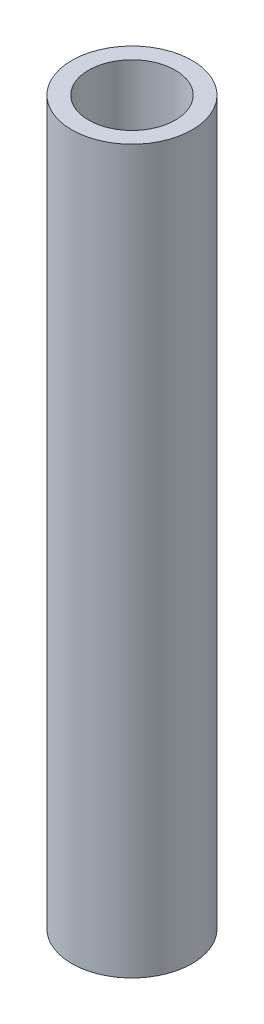
ISO-10303-21;
HEADER;
FILE_DESCRIPTION(('STEP AP214'),'2;1');
FILE_NAME('part.step','',(''),(''),'','','');
FILE_SCHEMA(('AUTOMOTIVE_DESIGN { 1 0 10303 214 1 1 1 1 }'));
ENDSEC;
DATA;
#1=APPLICATION_CONTEXT('core data for automotive mechanical design processes');
#2=APPLICATION_PROTOCOL_DEFINITION('international standard','automotive_design',2000,#1);
#3=PRODUCT_CONTEXT('',#1,'mechanical');
#4=PRODUCT('Part','Part','',(#3));
#5=PRODUCT_RELATED_PRODUCT_CATEGORY('part','',(#4));
#6=PRODUCT_DEFINITION_FORMATION('','',#4);
#7=PRODUCT_DEFINITION_CONTEXT('part definition',#1,'design');
#8=PRODUCT_DEFINITION('design','',#6,#7);
#9=PRODUCT_DEFINITION_SHAPE('','',#8);
#10=(LENGTH_UNIT() NAMED_UNIT(*) SI_UNIT(.MILLI.,.METRE.));
#11=(NAMED_UNIT(*) PLANE_ANGLE_UNIT() SI_UNIT($,.RADIAN.));
#12=(NAMED_UNIT(*) SI_UNIT($,.STERADIAN.) SOLID_ANGLE_UNIT());
#13=UNCERTAINTY_MEASURE_WITH_UNIT(LENGTH_MEASURE(1.E-05),#10,'distance_accuracy_value','');
#14=(GEOMETRIC_REPRESENTATION_CONTEXT(3) GLOBAL_UNCERTAINTY_ASSIGNED_CONTEXT((#13)) GLOBAL_UNIT_ASSIGNED_CONTEXT((#10,
#11,#12)) REPRESENTATION_CONTEXT('',''));
#15=CARTESIAN_POINT('',(0.,0.,0.));
#16=DIRECTION('',(0.,0.,1.));
#17=DIRECTION('',(1.,0.,0.));
#18=AXIS2_PLACEMENT_3D('',#15,#16,#17);
#19=CARTESIAN_POINT('',(0.,38.1,0.));
#20=DIRECTION('',(0.,1.,0.));
#21=DIRECTION('',(0.,0.,1.));
#22=AXIS2_PLACEMENT_3D('',#19,#20,#21);
#23=PLANE('',#22);
#24=CARTESIAN_POINT('',(0.,38.1,0.));
#25=DIRECTION('',(0.,1.,0.));
#26=DIRECTION('',(0.,0.,1.));
#27=AXIS2_PLACEMENT_3D('',#24,#25,#26);
#28=CIRCLE('',#27,3.175);
#29=CARTESIAN_POINT('',(0.,38.1,3.175));
#30=VERTEX_POINT('',#29);
#31=EDGE_CURVE('E10',#30,#30,#28,.T.);
#32=ORIENTED_EDGE('',*,*,#31,.T.);
#33=EDGE_LOOP('',(#32));
#34=FACE_BOUND('',#33,.T.);
#35=CARTESIAN_POINT('',(0.,38.1,0.));
#36=DIRECTION('',(0.,1.,0.));
#37=DIRECTION('',(0.,0.,1.));
#38=AXIS2_PLACEMENT_3D('',#35,#36,#37);
#39=CIRCLE('',#38,2.286);
#40=CARTESIAN_POINT('',(0.,38.1,2.286));
#41=VERTEX_POINT('',#40);
#42=EDGE_CURVE('E43',#41,#41,#39,.T.);
#43=ORIENTED_EDGE('',*,*,#42,.F.);
#44=EDGE_LOOP('',(#43));
#45=FACE_BOUND('',#44,.T.);
#46=ADVANCED_FACE('F32',(#34,#45),#23,.T.);
#47=CARTESIAN_POINT('',(0.,0.,0.));
#48=DIRECTION('',(0.,1.,0.));
#49=DIRECTION('',(0.,0.,1.));
#50=AXIS2_PLACEMENT_3D('',#47,#48,#49);
#51=PLANE('',#50);
#52=CARTESIAN_POINT('',(0.,0.,0.));
#53=DIRECTION('',(0.,1.,0.));
#54=DIRECTION('',(0.,0.,1.));
#55=AXIS2_PLACEMENT_3D('',#52,#53,#54);
#56=CIRCLE('',#55,3.175);
#57=CARTESIAN_POINT('',(0.,0.,3.175));
#58=VERTEX_POINT('',#57);
#59=EDGE_CURVE('E36',#58,#58,#56,.T.);
#60=ORIENTED_EDGE('',*,*,#59,.F.);
#61=EDGE_LOOP('',(#60));
#62=FACE_BOUND('',#61,.T.);
#63=CARTESIAN_POINT('',(0.,0.,0.));
#64=DIRECTION('',(0.,1.,0.));
#65=DIRECTION('',(0.,0.,1.));
#66=AXIS2_PLACEMENT_3D('',#63,#64,#65);
#67=CIRCLE('',#66,2.286);
#68=CARTESIAN_POINT('',(0.,0.,2.286));
#69=VERTEX_POINT('',#68);
#70=EDGE_CURVE('E45',#69,#69,#67,.T.);
#71=ORIENTED_EDGE('',*,*,#70,.T.);
#72=EDGE_LOOP('',(#71));
#73=FACE_BOUND('',#72,.T.);
#74=ADVANCED_FACE('F55',(#62,#73),#51,.F.);
#75=CARTESIAN_POINT('',(0.,38.1,0.));
#76=DIRECTION('',(0.,-1.,0.));
#77=DIRECTION('',(0.,0.,-1.));
#78=AXIS2_PLACEMENT_3D('',#75,#76,#77);
#79=CYLINDRICAL_SURFACE('',#78,3.175);
#80=ORIENTED_EDGE('',*,*,#31,.F.);
#81=EDGE_LOOP('',(#80));
#82=FACE_BOUND('',#81,.T.);
#83=ORIENTED_EDGE('',*,*,#59,.T.);
#84=EDGE_LOOP('',(#83));
#85=FACE_BOUND('',#84,.T.);
#86=ADVANCED_FACE('F34',(#82,#85),#79,.T.);
#87=CARTESIAN_POINT('',(0.,38.1,0.));
#88=DIRECTION('',(0.,-1.,0.));
#89=DIRECTION('',(0.,0.,-1.));
#90=AXIS2_PLACEMENT_3D('',#87,#88,#89);
#91=CYLINDRICAL_SURFACE('',#90,2.286);
#92=ORIENTED_EDGE('',*,*,#42,.T.);
#93=EDGE_LOOP('',(#92));
#94=FACE_BOUND('',#93,.T.);
#95=ORIENTED_EDGE('',*,*,#70,.F.);
#96=EDGE_LOOP('',(#95));
#97=FACE_BOUND('',#96,.T.);
#98=ADVANCED_FACE('F51',(#94,#97),#91,.F.);
#99=CLOSED_SHELL('',(#46,#74,#86,#98));
#100=MANIFOLD_SOLID_BREP('B2',#99);
#101=ADVANCED_BREP_SHAPE_REPRESENTATION('',(#18,#100),#14);
#102=SHAPE_DEFINITION_REPRESENTATION(#9,#101);
ENDSEC;
END-ISO-10303-21;
